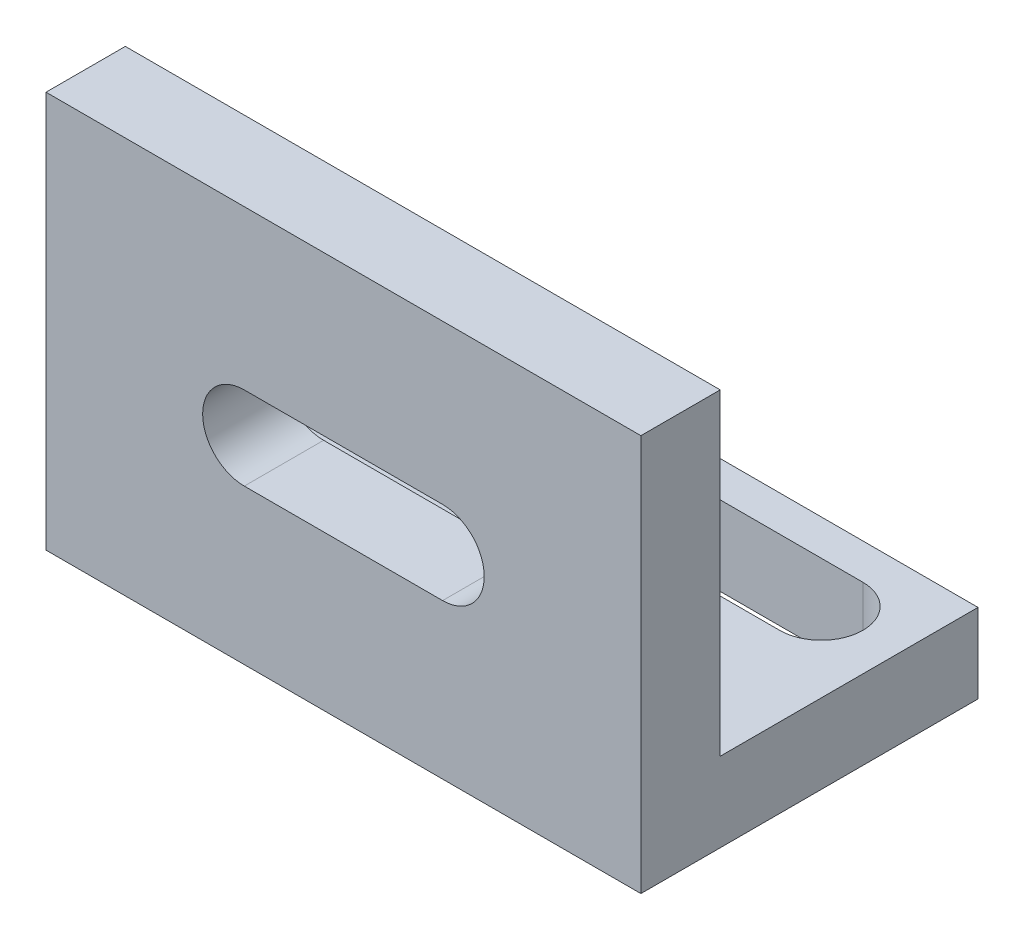
ISO-10303-21;
HEADER;
FILE_DESCRIPTION(('STEP AP214'),'2;1');
FILE_NAME('part.step','',(''),(''),'','','');
FILE_SCHEMA(('AUTOMOTIVE_DESIGN { 1 0 10303 214 1 1 1 1 }'));
ENDSEC;
DATA;
#1=APPLICATION_CONTEXT('core data for automotive mechanical design processes');
#2=APPLICATION_PROTOCOL_DEFINITION('international standard','automotive_design',2000,#1);
#3=PRODUCT_CONTEXT('',#1,'mechanical');
#4=PRODUCT('Part','Part','',(#3));
#5=PRODUCT_RELATED_PRODUCT_CATEGORY('part','',(#4));
#6=PRODUCT_DEFINITION_FORMATION('','',#4);
#7=PRODUCT_DEFINITION_CONTEXT('part definition',#1,'design');
#8=PRODUCT_DEFINITION('design','',#6,#7);
#9=PRODUCT_DEFINITION_SHAPE('','',#8);
#10=(LENGTH_UNIT() NAMED_UNIT(*) SI_UNIT(.MILLI.,.METRE.));
#11=(NAMED_UNIT(*) PLANE_ANGLE_UNIT() SI_UNIT($,.RADIAN.));
#12=(NAMED_UNIT(*) SI_UNIT($,.STERADIAN.) SOLID_ANGLE_UNIT());
#13=UNCERTAINTY_MEASURE_WITH_UNIT(LENGTH_MEASURE(1.E-05),#10,'distance_accuracy_value','');
#14=(GEOMETRIC_REPRESENTATION_CONTEXT(3) GLOBAL_UNCERTAINTY_ASSIGNED_CONTEXT((#13)) GLOBAL_UNIT_ASSIGNED_CONTEXT((#10,
#11,#12)) REPRESENTATION_CONTEXT('',''));
#15=CARTESIAN_POINT('',(0.,0.,0.));
#16=DIRECTION('',(0.,0.,1.));
#17=DIRECTION('',(1.,0.,0.));
#18=AXIS2_PLACEMENT_3D('',#15,#16,#17);
#19=CARTESIAN_POINT('',(-44.2592592592593,4.,0.));
#20=DIRECTION('',(1.,0.,0.));
#21=DIRECTION('',(0.,0.,-1.));
#22=AXIS2_PLACEMENT_3D('',#19,#20,#21);
#23=PLANE('',#22);
#24=DIRECTION('',(0.,0.,1.));
#25=VECTOR('',#24,1.);
#26=CARTESIAN_POINT('',(-44.2592592592593,0.,0.));
#27=LINE('',#26,#25);
#28=CARTESIAN_POINT('',(-44.2592592592593,0.,-11.3888888888889));
#29=VERTEX_POINT('',#28);
#30=CARTESIAN_POINT('',(-44.2592592592593,0.,5.61111111111111));
#31=VERTEX_POINT('',#30);
#32=EDGE_CURVE('E211',#29,#31,#27,.T.);
#33=ORIENTED_EDGE('',*,*,#32,.T.);
#34=DIRECTION('',(0.,-1.,0.));
#35=VECTOR('',#34,1.);
#36=CARTESIAN_POINT('',(-44.2592592592593,4.,5.61111111111111));
#37=LINE('',#36,#35);
#38=CARTESIAN_POINT('',(-44.2592592592593,20.,5.61111111111111));
#39=VERTEX_POINT('',#38);
#40=EDGE_CURVE('E237',#39,#31,#37,.T.);
#41=ORIENTED_EDGE('',*,*,#40,.F.);
#42=DIRECTION('',(0.,0.,1.));
#43=VECTOR('',#42,1.);
#44=CARTESIAN_POINT('',(-44.2592592592593,20.,5.61111111111111));
#45=LINE('',#44,#43);
#46=CARTESIAN_POINT('',(-44.2592592592593,20.,1.61111111111111));
#47=VERTEX_POINT('',#46);
#48=EDGE_CURVE('E193',#47,#39,#45,.T.);
#49=ORIENTED_EDGE('',*,*,#48,.F.);
#50=DIRECTION('',(0.,-1.,0.));
#51=VECTOR('',#50,1.);
#52=CARTESIAN_POINT('',(-44.2592592592593,20.,1.61111111111111));
#53=LINE('',#52,#51);
#54=CARTESIAN_POINT('',(-44.2592592592593,4.,1.61111111111111));
#55=VERTEX_POINT('',#54);
#56=EDGE_CURVE('E203',#47,#55,#53,.T.);
#57=ORIENTED_EDGE('',*,*,#56,.T.);
#58=DIRECTION('',(0.,0.,1.));
#59=VECTOR('',#58,1.);
#60=CARTESIAN_POINT('',(-44.2592592592593,4.,0.));
#61=LINE('',#60,#59);
#62=CARTESIAN_POINT('',(-44.2592592592593,4.,-11.3888888888889));
#63=VERTEX_POINT('',#62);
#64=EDGE_CURVE('E212',#63,#55,#61,.T.);
#65=ORIENTED_EDGE('',*,*,#64,.F.);
#66=DIRECTION('',(0.,-1.,0.));
#67=VECTOR('',#66,1.);
#68=CARTESIAN_POINT('',(-44.2592592592593,4.,-11.3888888888889));
#69=LINE('',#68,#67);
#70=EDGE_CURVE('E221',#63,#29,#69,.T.);
#71=ORIENTED_EDGE('',*,*,#70,.T.);
#72=EDGE_LOOP('',(#33,#41,#49,#57,#65,#71));
#73=FACE_BOUND('',#72,.T.);
#74=ADVANCED_FACE('F35',(#73),#23,.F.);
#75=CARTESIAN_POINT('',(0.,4.,5.61111111111111));
#76=DIRECTION('',(0.,0.,-1.));
#77=DIRECTION('',(-1.,0.,0.));
#78=AXIS2_PLACEMENT_3D('',#75,#76,#77);
#79=PLANE('',#78);
#80=DIRECTION('',(1.,0.,0.));
#81=VECTOR('',#80,1.);
#82=CARTESIAN_POINT('',(0.,11.9972184246575,5.61111111111111));
#83=LINE('',#82,#81);
#84=CARTESIAN_POINT('',(-34.2592592592593,11.9972184246575,5.61111111111111));
#85=VERTEX_POINT('',#84);
#86=CARTESIAN_POINT('',(-24.2592592592593,11.9972184246575,5.61111111111111));
#87=VERTEX_POINT('',#86);
#88=EDGE_CURVE('E166',#85,#87,#83,.T.);
#89=ORIENTED_EDGE('',*,*,#88,.T.);
#90=CARTESIAN_POINT('',(-24.2592592592593,9.89721842465749,5.61111111111111));
#91=DIRECTION('',(0.,0.,-1.));
#92=DIRECTION('',(-1.,0.,0.));
#93=AXIS2_PLACEMENT_3D('',#90,#91,#92);
#94=CIRCLE('',#93,2.1);
#95=CARTESIAN_POINT('',(-24.2592592592593,7.79721842465749,5.61111111111111));
#96=VERTEX_POINT('',#95);
#97=EDGE_CURVE('E169',#87,#96,#94,.T.);
#98=ORIENTED_EDGE('',*,*,#97,.T.);
#99=DIRECTION('',(-1.,0.,0.));
#100=VECTOR('',#99,1.);
#101=CARTESIAN_POINT('',(0.,7.79721842465749,5.61111111111111));
#102=LINE('',#101,#100);
#103=CARTESIAN_POINT('',(-34.2592592592593,7.79721842465749,5.61111111111111));
#104=VERTEX_POINT('',#103);
#105=EDGE_CURVE('E161',#96,#104,#102,.T.);
#106=ORIENTED_EDGE('',*,*,#105,.T.);
#107=CARTESIAN_POINT('',(-34.2592592592593,9.89721842465749,5.61111111111111));
#108=DIRECTION('',(0.,0.,-1.));
#109=DIRECTION('',(-1.,0.,0.));
#110=AXIS2_PLACEMENT_3D('',#107,#108,#109);
#111=CIRCLE('',#110,2.1);
#112=EDGE_CURVE('E141',#104,#85,#111,.T.);
#113=ORIENTED_EDGE('',*,*,#112,.T.);
#114=EDGE_LOOP('',(#89,#98,#106,#113));
#115=FACE_BOUND('',#114,.T.);
#116=DIRECTION('',(1.,0.,0.));
#117=VECTOR('',#116,1.);
#118=CARTESIAN_POINT('',(0.,0.,5.61111111111111));
#119=LINE('',#118,#117);
#120=CARTESIAN_POINT('',(-14.2592592592593,0.,5.61111111111111));
#121=VERTEX_POINT('',#120);
#122=EDGE_CURVE('E224',#31,#121,#119,.T.);
#123=ORIENTED_EDGE('',*,*,#122,.T.);
#124=DIRECTION('',(0.,-1.,0.));
#125=VECTOR('',#124,1.);
#126=CARTESIAN_POINT('',(-14.2592592592593,4.,5.61111111111111));
#127=LINE('',#126,#125);
#128=CARTESIAN_POINT('',(-14.2592592592593,20.,5.61111111111111));
#129=VERTEX_POINT('',#128);
#130=EDGE_CURVE('E235',#129,#121,#127,.T.);
#131=ORIENTED_EDGE('',*,*,#130,.F.);
#132=DIRECTION('',(1.,0.,0.));
#133=VECTOR('',#132,1.);
#134=CARTESIAN_POINT('',(-44.2592592592593,20.,5.61111111111111));
#135=LINE('',#134,#133);
#136=EDGE_CURVE('E196',#39,#129,#135,.T.);
#137=ORIENTED_EDGE('',*,*,#136,.F.);
#138=ORIENTED_EDGE('',*,*,#40,.T.);
#139=EDGE_LOOP('',(#123,#131,#137,#138));
#140=FACE_BOUND('',#139,.T.);
#141=ADVANCED_FACE('F280',(#115,#140),#79,.F.);
#142=CARTESIAN_POINT('',(-14.2592592592593,4.,0.));
#143=DIRECTION('',(1.,0.,0.));
#144=DIRECTION('',(0.,0.,-1.));
#145=AXIS2_PLACEMENT_3D('',#142,#143,#144);
#146=PLANE('',#145);
#147=DIRECTION('',(0.,0.,1.));
#148=VECTOR('',#147,1.);
#149=CARTESIAN_POINT('',(-14.2592592592593,0.,0.));
#150=LINE('',#149,#148);
#151=CARTESIAN_POINT('',(-14.2592592592593,0.,-11.3888888888889));
#152=VERTEX_POINT('',#151);
#153=EDGE_CURVE('E227',#152,#121,#150,.T.);
#154=ORIENTED_EDGE('',*,*,#153,.F.);
#155=DIRECTION('',(0.,-1.,0.));
#156=VECTOR('',#155,1.);
#157=CARTESIAN_POINT('',(-14.2592592592593,4.,-11.3888888888889));
#158=LINE('',#157,#156);
#159=CARTESIAN_POINT('',(-14.2592592592593,4.,-11.3888888888889));
#160=VERTEX_POINT('',#159);
#161=EDGE_CURVE('E233',#160,#152,#158,.T.);
#162=ORIENTED_EDGE('',*,*,#161,.F.);
#163=DIRECTION('',(0.,0.,1.));
#164=VECTOR('',#163,1.);
#165=CARTESIAN_POINT('',(-14.2592592592593,4.,0.));
#166=LINE('',#165,#164);
#167=CARTESIAN_POINT('',(-14.2592592592593,4.,1.61111111111111));
#168=VERTEX_POINT('',#167);
#169=EDGE_CURVE('E214',#160,#168,#166,.T.);
#170=ORIENTED_EDGE('',*,*,#169,.T.);
#171=DIRECTION('',(0.,-1.,0.));
#172=VECTOR('',#171,1.);
#173=CARTESIAN_POINT('',(-14.2592592592593,20.,1.61111111111111));
#174=LINE('',#173,#172);
#175=CARTESIAN_POINT('',(-14.2592592592593,20.,1.61111111111111));
#176=VERTEX_POINT('',#175);
#177=EDGE_CURVE('E208',#176,#168,#174,.T.);
#178=ORIENTED_EDGE('',*,*,#177,.F.);
#179=DIRECTION('',(0.,0.,-1.));
#180=VECTOR('',#179,1.);
#181=CARTESIAN_POINT('',(-14.2592592592593,20.,5.61111111111111));
#182=LINE('',#181,#180);
#183=EDGE_CURVE('E199',#129,#176,#182,.T.);
#184=ORIENTED_EDGE('',*,*,#183,.F.);
#185=ORIENTED_EDGE('',*,*,#130,.T.);
#186=EDGE_LOOP('',(#154,#162,#170,#178,#184,#185));
#187=FACE_BOUND('',#186,.T.);
#188=ADVANCED_FACE('F285',(#187),#146,.T.);
#189=CARTESIAN_POINT('',(0.,4.,-11.3888888888889));
#190=DIRECTION('',(0.,0.,-1.));
#191=DIRECTION('',(-1.,0.,0.));
#192=AXIS2_PLACEMENT_3D('',#189,#190,#191);
#193=PLANE('',#192);
#194=DIRECTION('',(1.,0.,0.));
#195=VECTOR('',#194,1.);
#196=CARTESIAN_POINT('',(0.,0.,-11.3888888888889));
#197=LINE('',#196,#195);
#198=EDGE_CURVE('E215',#29,#152,#197,.T.);
#199=ORIENTED_EDGE('',*,*,#198,.F.);
#200=ORIENTED_EDGE('',*,*,#70,.F.);
#201=DIRECTION('',(1.,0.,0.));
#202=VECTOR('',#201,1.);
#203=CARTESIAN_POINT('',(0.,4.,-11.3888888888889));
#204=LINE('',#203,#202);
#205=EDGE_CURVE('E218',#63,#160,#204,.T.);
#206=ORIENTED_EDGE('',*,*,#205,.T.);
#207=ORIENTED_EDGE('',*,*,#161,.T.);
#208=EDGE_LOOP('',(#199,#200,#206,#207));
#209=FACE_BOUND('',#208,.T.);
#210=ADVANCED_FACE('F293',(#209),#193,.T.);
#211=CARTESIAN_POINT('',(0.,4.,0.));
#212=DIRECTION('',(0.,1.,0.));
#213=DIRECTION('',(0.,0.,1.));
#214=AXIS2_PLACEMENT_3D('',#211,#212,#213);
#215=PLANE('',#214);
#216=CARTESIAN_POINT('',(-18.2592592592593,4.,-7.48496830728263));
#217=DIRECTION('',(0.,1.,0.));
#218=DIRECTION('',(0.,0.,1.));
#219=AXIS2_PLACEMENT_3D('',#216,#217,#218);
#220=CIRCLE('',#219,2.1);
#221=CARTESIAN_POINT('',(-18.2592592592593,4.,-5.38496830728263));
#222=VERTEX_POINT('',#221);
#223=CARTESIAN_POINT('',(-18.2592592592593,4.,-9.58496830728263));
#224=VERTEX_POINT('',#223);
#225=EDGE_CURVE('E172',#222,#224,#220,.T.);
#226=ORIENTED_EDGE('',*,*,#225,.F.);
#227=DIRECTION('',(1.,0.,0.));
#228=VECTOR('',#227,1.);
#229=CARTESIAN_POINT('',(-18.2592592592593,4.,-5.38496830728263));
#230=LINE('',#229,#228);
#231=CARTESIAN_POINT('',(-40.2592592592593,4.,-5.38496830728263));
#232=VERTEX_POINT('',#231);
#233=EDGE_CURVE('E180',#232,#222,#230,.T.);
#234=ORIENTED_EDGE('',*,*,#233,.F.);
#235=CARTESIAN_POINT('',(-40.2592592592593,4.,-7.48496830728263));
#236=DIRECTION('',(0.,1.,0.));
#237=DIRECTION('',(0.,0.,1.));
#238=AXIS2_PLACEMENT_3D('',#235,#236,#237);
#239=CIRCLE('',#238,2.1);
#240=CARTESIAN_POINT('',(-40.2592592592593,4.,-9.58496830728263));
#241=VERTEX_POINT('',#240);
#242=EDGE_CURVE('E177',#241,#232,#239,.T.);
#243=ORIENTED_EDGE('',*,*,#242,.F.);
#244=DIRECTION('',(-1.,0.,0.));
#245=VECTOR('',#244,1.);
#246=CARTESIAN_POINT('',(-18.2592592592593,4.,-9.58496830728263));
#247=LINE('',#246,#245);
#248=EDGE_CURVE('E174',#224,#241,#247,.T.);
#249=ORIENTED_EDGE('',*,*,#248,.F.);
#250=EDGE_LOOP('',(#226,#234,#243,#249));
#251=FACE_BOUND('',#250,.T.);
#252=DIRECTION('',(-1.,0.,0.));
#253=VECTOR('',#252,1.);
#254=CARTESIAN_POINT('',(-44.2592592592593,4.,1.61111111111111));
#255=LINE('',#254,#253);
#256=EDGE_CURVE('E186',#168,#55,#255,.T.);
#257=ORIENTED_EDGE('',*,*,#256,.F.);
#258=ORIENTED_EDGE('',*,*,#169,.F.);
#259=ORIENTED_EDGE('',*,*,#205,.F.);
#260=ORIENTED_EDGE('',*,*,#64,.T.);
#261=EDGE_LOOP('',(#257,#258,#259,#260));
#262=FACE_BOUND('',#261,.T.);
#263=ADVANCED_FACE('F261',(#251,#262),#215,.T.);
#264=CARTESIAN_POINT('',(0.,0.,0.));
#265=DIRECTION('',(0.,1.,0.));
#266=DIRECTION('',(0.,0.,1.));
#267=AXIS2_PLACEMENT_3D('',#264,#265,#266);
#268=PLANE('',#267);
#269=DIRECTION('',(1.,0.,0.));
#270=VECTOR('',#269,1.);
#271=CARTESIAN_POINT('',(0.,0.,-5.38496830728263));
#272=LINE('',#271,#270);
#273=CARTESIAN_POINT('',(-40.2592592592593,0.,-5.38496830728263));
#274=VERTEX_POINT('',#273);
#275=CARTESIAN_POINT('',(-18.2592592592593,0.,-5.38496830728263));
#276=VERTEX_POINT('',#275);
#277=EDGE_CURVE('E42',#274,#276,#272,.T.);
#278=ORIENTED_EDGE('',*,*,#277,.T.);
#279=CARTESIAN_POINT('',(-18.2592592592593,0.,-7.48496830728263));
#280=DIRECTION('',(0.,1.,0.));
#281=DIRECTION('',(0.,0.,1.));
#282=AXIS2_PLACEMENT_3D('',#279,#280,#281);
#283=CIRCLE('',#282,2.1);
#284=CARTESIAN_POINT('',(-18.2592592592593,0.,-9.58496830728263));
#285=VERTEX_POINT('',#284);
#286=EDGE_CURVE('E11',#276,#285,#283,.T.);
#287=ORIENTED_EDGE('',*,*,#286,.T.);
#288=DIRECTION('',(-1.,0.,0.));
#289=VECTOR('',#288,1.);
#290=CARTESIAN_POINT('',(0.,0.,-9.58496830728264));
#291=LINE('',#290,#289);
#292=CARTESIAN_POINT('',(-40.2592592592593,0.,-9.58496830728263));
#293=VERTEX_POINT('',#292);
#294=EDGE_CURVE('E240',#285,#293,#291,.T.);
#295=ORIENTED_EDGE('',*,*,#294,.T.);
#296=CARTESIAN_POINT('',(-40.2592592592593,0.,-7.48496830728263));
#297=DIRECTION('',(0.,1.,0.));
#298=DIRECTION('',(0.,0.,1.));
#299=AXIS2_PLACEMENT_3D('',#296,#297,#298);
#300=CIRCLE('',#299,2.1);
#301=EDGE_CURVE('E243',#293,#274,#300,.T.);
#302=ORIENTED_EDGE('',*,*,#301,.T.);
#303=EDGE_LOOP('',(#278,#287,#295,#302));
#304=FACE_BOUND('',#303,.T.);
#305=ORIENTED_EDGE('',*,*,#32,.F.);
#306=ORIENTED_EDGE('',*,*,#198,.T.);
#307=ORIENTED_EDGE('',*,*,#153,.T.);
#308=ORIENTED_EDGE('',*,*,#122,.F.);
#309=EDGE_LOOP('',(#305,#306,#307,#308));
#310=FACE_BOUND('',#309,.T.);
#311=ADVANCED_FACE('F247',(#304,#310),#268,.F.);
#312=CARTESIAN_POINT('',(-44.2592592592593,20.,1.61111111111111));
#313=DIRECTION('',(0.,0.,1.));
#314=DIRECTION('',(1.,0.,0.));
#315=AXIS2_PLACEMENT_3D('',#312,#313,#314);
#316=PLANE('',#315);
#317=DIRECTION('',(-1.,0.,0.));
#318=VECTOR('',#317,1.);
#319=CARTESIAN_POINT('',(-24.2592592592593,7.79721842465749,1.61111111111111));
#320=LINE('',#319,#318);
#321=CARTESIAN_POINT('',(-24.2592592592593,7.79721842465749,1.61111111111111));
#322=VERTEX_POINT('',#321);
#323=CARTESIAN_POINT('',(-34.2592592592593,7.79721842465749,1.61111111111111));
#324=VERTEX_POINT('',#323);
#325=EDGE_CURVE('E147',#322,#324,#320,.T.);
#326=ORIENTED_EDGE('',*,*,#325,.F.);
#327=CARTESIAN_POINT('',(-24.2592592592593,9.89721842465749,1.61111111111111));
#328=DIRECTION('',(0.,0.,-1.));
#329=DIRECTION('',(-1.,0.,0.));
#330=AXIS2_PLACEMENT_3D('',#327,#328,#329);
#331=CIRCLE('',#330,2.1);
#332=CARTESIAN_POINT('',(-24.2592592592593,11.9972184246575,1.61111111111111));
#333=VERTEX_POINT('',#332);
#334=EDGE_CURVE('E57',#333,#322,#331,.T.);
#335=ORIENTED_EDGE('',*,*,#334,.F.);
#336=DIRECTION('',(1.,0.,0.));
#337=VECTOR('',#336,1.);
#338=CARTESIAN_POINT('',(-24.2592592592593,11.9972184246575,1.61111111111111));
#339=LINE('',#338,#337);
#340=CARTESIAN_POINT('',(-34.2592592592593,11.9972184246575,1.61111111111111));
#341=VERTEX_POINT('',#340);
#342=EDGE_CURVE('E154',#341,#333,#339,.T.);
#343=ORIENTED_EDGE('',*,*,#342,.F.);
#344=CARTESIAN_POINT('',(-34.2592592592593,9.89721842465749,1.61111111111111));
#345=DIRECTION('',(0.,0.,-1.));
#346=DIRECTION('',(-1.,0.,0.));
#347=AXIS2_PLACEMENT_3D('',#344,#345,#346);
#348=CIRCLE('',#347,2.1);
#349=EDGE_CURVE('E138',#324,#341,#348,.T.);
#350=ORIENTED_EDGE('',*,*,#349,.F.);
#351=EDGE_LOOP('',(#326,#335,#343,#350));
#352=FACE_BOUND('',#351,.T.);
#353=ORIENTED_EDGE('',*,*,#256,.T.);
#354=ORIENTED_EDGE('',*,*,#56,.F.);
#355=DIRECTION('',(-1.,0.,0.));
#356=VECTOR('',#355,1.);
#357=CARTESIAN_POINT('',(-44.2592592592593,20.,1.61111111111111));
#358=LINE('',#357,#356);
#359=EDGE_CURVE('E201',#176,#47,#358,.T.);
#360=ORIENTED_EDGE('',*,*,#359,.F.);
#361=ORIENTED_EDGE('',*,*,#177,.T.);
#362=EDGE_LOOP('',(#353,#354,#360,#361));
#363=FACE_BOUND('',#362,.T.);
#364=ADVANCED_FACE('F151',(#352,#363),#316,.F.);
#365=CARTESIAN_POINT('',(0.,20.,0.));
#366=DIRECTION('',(0.,-1.,0.));
#367=DIRECTION('',(0.,0.,-1.));
#368=AXIS2_PLACEMENT_3D('',#365,#366,#367);
#369=PLANE('',#368);
#370=ORIENTED_EDGE('',*,*,#48,.T.);
#371=ORIENTED_EDGE('',*,*,#136,.T.);
#372=ORIENTED_EDGE('',*,*,#183,.T.);
#373=ORIENTED_EDGE('',*,*,#359,.T.);
#374=EDGE_LOOP('',(#370,#371,#372,#373));
#375=FACE_BOUND('',#374,.T.);
#376=ADVANCED_FACE('F302',(#375),#369,.F.);
#377=CARTESIAN_POINT('',(-18.2592592592593,-6.,-7.48496830728263));
#378=DIRECTION('',(0.,1.,0.));
#379=DIRECTION('',(0.,0.,1.));
#380=AXIS2_PLACEMENT_3D('',#377,#378,#379);
#381=CYLINDRICAL_SURFACE('',#380,2.1);
#382=DIRECTION('',(0.,1.,0.));
#383=VECTOR('',#382,1.);
#384=CARTESIAN_POINT('',(-18.2592592592593,-6.,-5.38496830728263));
#385=LINE('',#384,#383);
#386=EDGE_CURVE('E184',#276,#222,#385,.T.);
#387=ORIENTED_EDGE('',*,*,#386,.T.);
#388=ORIENTED_EDGE('',*,*,#225,.T.);
#389=DIRECTION('',(0.,1.,0.));
#390=VECTOR('',#389,1.);
#391=CARTESIAN_POINT('',(-18.2592592592593,-6.,-9.58496830728263));
#392=LINE('',#391,#390);
#393=EDGE_CURVE('E183',#285,#224,#392,.T.);
#394=ORIENTED_EDGE('',*,*,#393,.F.);
#395=ORIENTED_EDGE('',*,*,#286,.F.);
#396=EDGE_LOOP('',(#387,#388,#394,#395));
#397=FACE_BOUND('',#396,.T.);
#398=ADVANCED_FACE('F265',(#397),#381,.F.);
#399=CARTESIAN_POINT('',(-18.2592592592593,-6.,-5.38496830728263));
#400=DIRECTION('',(0.,0.,1.));
#401=DIRECTION('',(1.,0.,0.));
#402=AXIS2_PLACEMENT_3D('',#399,#400,#401);
#403=PLANE('',#402);
#404=DIRECTION('',(0.,1.,0.));
#405=VECTOR('',#404,1.);
#406=CARTESIAN_POINT('',(-40.2592592592593,-6.,-5.38496830728263));
#407=LINE('',#406,#405);
#408=EDGE_CURVE('E187',#274,#232,#407,.T.);
#409=ORIENTED_EDGE('',*,*,#408,.T.);
#410=ORIENTED_EDGE('',*,*,#233,.T.);
#411=ORIENTED_EDGE('',*,*,#386,.F.);
#412=ORIENTED_EDGE('',*,*,#277,.F.);
#413=EDGE_LOOP('',(#409,#410,#411,#412));
#414=FACE_BOUND('',#413,.T.);
#415=ADVANCED_FACE('F253',(#414),#403,.F.);
#416=CARTESIAN_POINT('',(-40.2592592592593,-6.,-7.48496830728263));
#417=DIRECTION('',(0.,1.,0.));
#418=DIRECTION('',(0.,0.,1.));
#419=AXIS2_PLACEMENT_3D('',#416,#417,#418);
#420=CYLINDRICAL_SURFACE('',#419,2.1);
#421=DIRECTION('',(0.,1.,0.));
#422=VECTOR('',#421,1.);
#423=CARTESIAN_POINT('',(-40.2592592592593,-6.,-9.58496830728263));
#424=LINE('',#423,#422);
#425=EDGE_CURVE('E189',#293,#241,#424,.T.);
#426=ORIENTED_EDGE('',*,*,#425,.T.);
#427=ORIENTED_EDGE('',*,*,#242,.T.);
#428=ORIENTED_EDGE('',*,*,#408,.F.);
#429=ORIENTED_EDGE('',*,*,#301,.F.);
#430=EDGE_LOOP('',(#426,#427,#428,#429));
#431=FACE_BOUND('',#430,.T.);
#432=ADVANCED_FACE('F255',(#431),#420,.F.);
#433=CARTESIAN_POINT('',(-18.2592592592593,-6.,-9.58496830728263));
#434=DIRECTION('',(0.,0.,-1.));
#435=DIRECTION('',(-1.,0.,0.));
#436=AXIS2_PLACEMENT_3D('',#433,#434,#435);
#437=PLANE('',#436);
#438=ORIENTED_EDGE('',*,*,#393,.T.);
#439=ORIENTED_EDGE('',*,*,#248,.T.);
#440=ORIENTED_EDGE('',*,*,#425,.F.);
#441=ORIENTED_EDGE('',*,*,#294,.F.);
#442=EDGE_LOOP('',(#438,#439,#440,#441));
#443=FACE_BOUND('',#442,.T.);
#444=ADVANCED_FACE('F267',(#443),#437,.F.);
#445=CARTESIAN_POINT('',(-24.2592592592593,9.89721842465749,11.6111111111111));
#446=DIRECTION('',(0.,0.,-1.));
#447=DIRECTION('',(-1.,0.,0.));
#448=AXIS2_PLACEMENT_3D('',#445,#446,#447);
#449=CYLINDRICAL_SURFACE('',#448,2.1);
#450=DIRECTION('',(0.,0.,-1.));
#451=VECTOR('',#450,1.);
#452=CARTESIAN_POINT('',(-24.2592592592593,11.9972184246575,11.6111111111111));
#453=LINE('',#452,#451);
#454=EDGE_CURVE('E159',#87,#333,#453,.T.);
#455=ORIENTED_EDGE('',*,*,#454,.T.);
#456=ORIENTED_EDGE('',*,*,#334,.T.);
#457=DIRECTION('',(0.,0.,-1.));
#458=VECTOR('',#457,1.);
#459=CARTESIAN_POINT('',(-24.2592592592593,7.79721842465749,11.6111111111111));
#460=LINE('',#459,#458);
#461=EDGE_CURVE('E144',#96,#322,#460,.T.);
#462=ORIENTED_EDGE('',*,*,#461,.F.);
#463=ORIENTED_EDGE('',*,*,#97,.F.);
#464=EDGE_LOOP('',(#455,#456,#462,#463));
#465=FACE_BOUND('',#464,.T.);
#466=ADVANCED_FACE('F269',(#465),#449,.F.);
#467=CARTESIAN_POINT('',(-24.2592592592593,11.9972184246575,11.6111111111111));
#468=DIRECTION('',(0.,1.,0.));
#469=DIRECTION('',(0.,0.,1.));
#470=AXIS2_PLACEMENT_3D('',#467,#468,#469);
#471=PLANE('',#470);
#472=DIRECTION('',(0.,0.,-1.));
#473=VECTOR('',#472,1.);
#474=CARTESIAN_POINT('',(-34.2592592592593,11.9972184246575,11.6111111111111));
#475=LINE('',#474,#473);
#476=EDGE_CURVE('E143',#85,#341,#475,.T.);
#477=ORIENTED_EDGE('',*,*,#476,.T.);
#478=ORIENTED_EDGE('',*,*,#342,.T.);
#479=ORIENTED_EDGE('',*,*,#454,.F.);
#480=ORIENTED_EDGE('',*,*,#88,.F.);
#481=EDGE_LOOP('',(#477,#478,#479,#480));
#482=FACE_BOUND('',#481,.T.);
#483=ADVANCED_FACE('F275',(#482),#471,.F.);
#484=CARTESIAN_POINT('',(-34.2592592592593,9.89721842465749,11.6111111111111));
#485=DIRECTION('',(0.,0.,-1.));
#486=DIRECTION('',(-1.,0.,0.));
#487=AXIS2_PLACEMENT_3D('',#484,#485,#486);
#488=CYLINDRICAL_SURFACE('',#487,2.1);
#489=DIRECTION('',(0.,0.,-1.));
#490=VECTOR('',#489,1.);
#491=CARTESIAN_POINT('',(-34.2592592592593,7.79721842465749,11.6111111111111));
#492=LINE('',#491,#490);
#493=EDGE_CURVE('E49',#104,#324,#492,.T.);
#494=ORIENTED_EDGE('',*,*,#493,.T.);
#495=ORIENTED_EDGE('',*,*,#349,.T.);
#496=ORIENTED_EDGE('',*,*,#476,.F.);
#497=ORIENTED_EDGE('',*,*,#112,.F.);
#498=EDGE_LOOP('',(#494,#495,#496,#497));
#499=FACE_BOUND('',#498,.T.);
#500=ADVANCED_FACE('F135',(#499),#488,.F.);
#501=CARTESIAN_POINT('',(-24.2592592592593,7.79721842465749,11.6111111111111));
#502=DIRECTION('',(0.,-1.,0.));
#503=DIRECTION('',(0.,0.,-1.));
#504=AXIS2_PLACEMENT_3D('',#501,#502,#503);
#505=PLANE('',#504);
#506=ORIENTED_EDGE('',*,*,#461,.T.);
#507=ORIENTED_EDGE('',*,*,#325,.T.);
#508=ORIENTED_EDGE('',*,*,#493,.F.);
#509=ORIENTED_EDGE('',*,*,#105,.F.);
#510=EDGE_LOOP('',(#506,#507,#508,#509));
#511=FACE_BOUND('',#510,.T.);
#512=ADVANCED_FACE('F148',(#511),#505,.F.);
#513=CLOSED_SHELL('',(#74,#141,#188,#210,#263,#311,#364,#376,#398,#415,#432,#444,#466,#483,#500,#512));
#514=MANIFOLD_SOLID_BREP('B2',#513);
#515=ADVANCED_BREP_SHAPE_REPRESENTATION('',(#18,#514),#14);
#516=SHAPE_DEFINITION_REPRESENTATION(#9,#515);
ENDSEC;
END-ISO-10303-21;
